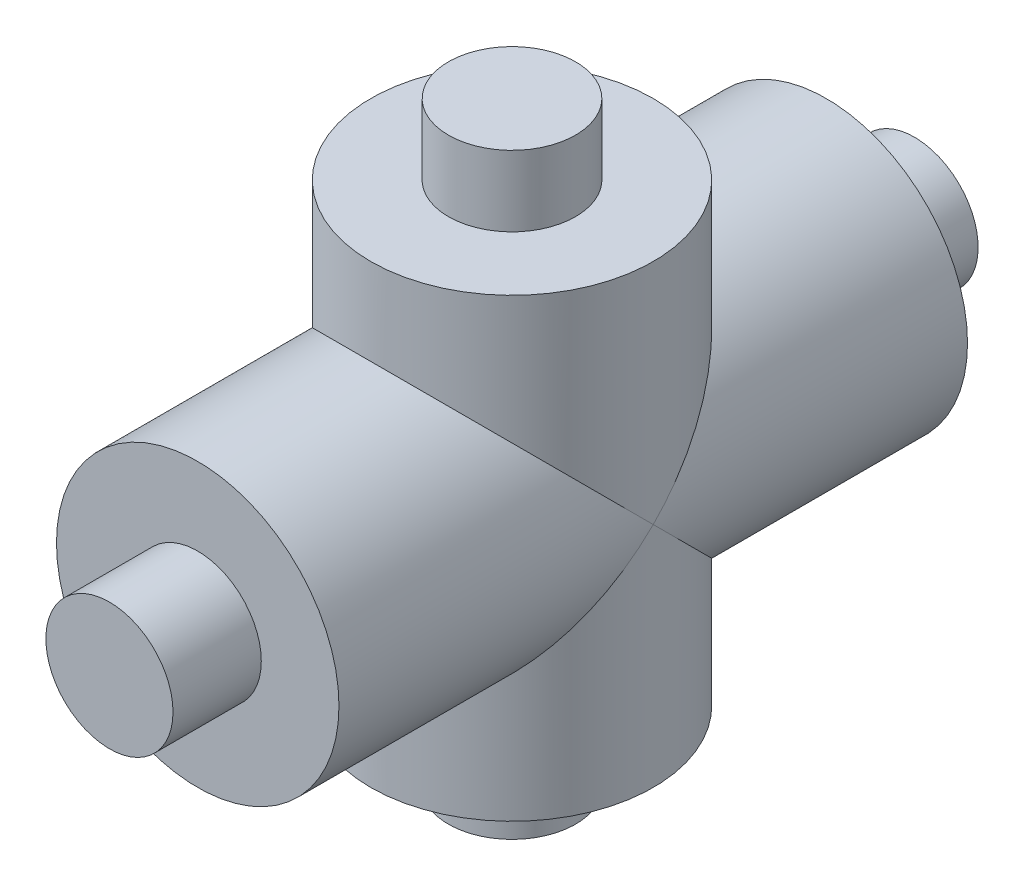
ISO-10303-21;
HEADER;
FILE_DESCRIPTION(('STEP AP214'),'2;1');
FILE_NAME('part.step','',(''),(''),'','','');
FILE_SCHEMA(('AUTOMOTIVE_DESIGN { 1 0 10303 214 1 1 1 1 }'));
ENDSEC;
DATA;
#1=APPLICATION_CONTEXT('core data for automotive mechanical design processes');
#2=APPLICATION_PROTOCOL_DEFINITION('international standard','automotive_design',2000,#1);
#3=PRODUCT_CONTEXT('',#1,'mechanical');
#4=PRODUCT('Part','Part','',(#3));
#5=PRODUCT_RELATED_PRODUCT_CATEGORY('part','',(#4));
#6=PRODUCT_DEFINITION_FORMATION('','',#4);
#7=PRODUCT_DEFINITION_CONTEXT('part definition',#1,'design');
#8=PRODUCT_DEFINITION('design','',#6,#7);
#9=PRODUCT_DEFINITION_SHAPE('','',#8);
#10=(LENGTH_UNIT() NAMED_UNIT(*) SI_UNIT(.MILLI.,.METRE.));
#11=(NAMED_UNIT(*) PLANE_ANGLE_UNIT() SI_UNIT($,.RADIAN.));
#12=(NAMED_UNIT(*) SI_UNIT($,.STERADIAN.) SOLID_ANGLE_UNIT());
#13=UNCERTAINTY_MEASURE_WITH_UNIT(LENGTH_MEASURE(1.E-05),#10,'distance_accuracy_value','');
#14=(GEOMETRIC_REPRESENTATION_CONTEXT(3) GLOBAL_UNCERTAINTY_ASSIGNED_CONTEXT((#13)) GLOBAL_UNIT_ASSIGNED_CONTEXT((#10,
#11,#12)) REPRESENTATION_CONTEXT('',''));
#15=CARTESIAN_POINT('',(0.,0.,0.));
#16=DIRECTION('',(0.,0.,1.));
#17=DIRECTION('',(1.,0.,0.));
#18=AXIS2_PLACEMENT_3D('',#15,#16,#17);
#19=CARTESIAN_POINT('',(0.,0.,17.8));
#20=DIRECTION('',(0.,0.,-1.));
#21=DIRECTION('',(-1.,0.,0.));
#22=AXIS2_PLACEMENT_3D('',#19,#20,#21);
#23=CYLINDRICAL_SURFACE('',#22,4.);
#24=CARTESIAN_POINT('',(0.,0.,8.9));
#25=DIRECTION('',(0.,-0.707106781186547,-0.707106781186548));
#26=DIRECTION('',(0.,0.707106781186547,-0.707106781186548));
#27=AXIS2_PLACEMENT_3D('',#24,#25,#26);
#28=ELLIPSE('',#27,5.65685424949238,4.);
#29=CARTESIAN_POINT('',(-4.,0.,8.9));
#30=VERTEX_POINT('',#29);
#31=CARTESIAN_POINT('',(4.,0.,8.9));
#32=VERTEX_POINT('',#31);
#33=EDGE_CURVE('E61',#30,#32,#28,.T.);
#34=ORIENTED_EDGE('',*,*,#33,.T.);
#35=CARTESIAN_POINT('',(0.,0.,8.9));
#36=DIRECTION('',(0.,0.707106781186547,-0.707106781186548));
#37=DIRECTION('',(0.,-0.707106781186547,-0.707106781186548));
#38=AXIS2_PLACEMENT_3D('',#35,#36,#37);
#39=ELLIPSE('',#38,5.65685424949238,4.);
#40=EDGE_CURVE('E66',#32,#30,#39,.T.);
#41=ORIENTED_EDGE('',*,*,#40,.T.);
#42=EDGE_LOOP('',(#34,#41));
#43=FACE_BOUND('',#42,.T.);
#44=CARTESIAN_POINT('',(0.,0.,0.));
#45=DIRECTION('',(0.,0.,1.));
#46=DIRECTION('',(1.,0.,0.));
#47=AXIS2_PLACEMENT_3D('',#44,#45,#46);
#48=CIRCLE('',#47,4.);
#49=CARTESIAN_POINT('',(4.,0.,0.));
#50=VERTEX_POINT('',#49);
#51=EDGE_CURVE('E78',#50,#50,#48,.T.);
#52=ORIENTED_EDGE('',*,*,#51,.T.);
#53=EDGE_LOOP('',(#52));
#54=FACE_BOUND('',#53,.T.);
#55=ADVANCED_FACE('F39',(#43,#54),#23,.T.);
#56=CARTESIAN_POINT('',(0.,0.,0.));
#57=DIRECTION('',(0.,0.,1.));
#58=DIRECTION('',(1.,0.,0.));
#59=AXIS2_PLACEMENT_3D('',#56,#57,#58);
#60=PLANE('',#59);
#61=CARTESIAN_POINT('',(0.,0.,0.));
#62=DIRECTION('',(0.,0.,-1.));
#63=DIRECTION('',(-1.,0.,0.));
#64=AXIS2_PLACEMENT_3D('',#61,#62,#63);
#65=CIRCLE('',#64,1.8);
#66=CARTESIAN_POINT('',(-1.8,0.,0.));
#67=VERTEX_POINT('',#66);
#68=EDGE_CURVE('E71',#67,#67,#65,.T.);
#69=ORIENTED_EDGE('',*,*,#68,.F.);
#70=EDGE_LOOP('',(#69));
#71=FACE_BOUND('',#70,.T.);
#72=ORIENTED_EDGE('',*,*,#51,.F.);
#73=EDGE_LOOP('',(#72));
#74=FACE_BOUND('',#73,.T.);
#75=ADVANCED_FACE('F147',(#71,#74),#60,.F.);
#76=CARTESIAN_POINT('',(0.,0.,-2.5));
#77=DIRECTION('',(0.,0.,1.));
#78=DIRECTION('',(1.,0.,0.));
#79=AXIS2_PLACEMENT_3D('',#76,#77,#78);
#80=CYLINDRICAL_SURFACE('',#79,1.8);
#81=CARTESIAN_POINT('',(0.,0.,-2.5));
#82=DIRECTION('',(0.,0.,-1.));
#83=DIRECTION('',(-1.,0.,0.));
#84=AXIS2_PLACEMENT_3D('',#81,#82,#83);
#85=CIRCLE('',#84,1.8);
#86=CARTESIAN_POINT('',(-1.8,0.,-2.5));
#87=VERTEX_POINT('',#86);
#88=EDGE_CURVE('E94',#87,#87,#85,.T.);
#89=ORIENTED_EDGE('',*,*,#88,.F.);
#90=EDGE_LOOP('',(#89));
#91=FACE_BOUND('',#90,.T.);
#92=ORIENTED_EDGE('',*,*,#68,.T.);
#93=EDGE_LOOP('',(#92));
#94=FACE_BOUND('',#93,.T.);
#95=ADVANCED_FACE('F151',(#91,#94),#80,.T.);
#96=CARTESIAN_POINT('',(0.,0.,-2.5));
#97=DIRECTION('',(0.,0.,-1.));
#98=DIRECTION('',(-1.,0.,0.));
#99=AXIS2_PLACEMENT_3D('',#96,#97,#98);
#100=PLANE('',#99);
#101=ORIENTED_EDGE('',*,*,#88,.T.);
#102=EDGE_LOOP('',(#101));
#103=FACE_BOUND('',#102,.T.);
#104=ADVANCED_FACE('F179',(#103),#100,.T.);
#105=CARTESIAN_POINT('',(0.,-6.45,8.9));
#106=DIRECTION('',(0.,1.,0.));
#107=DIRECTION('',(0.,0.,1.));
#108=AXIS2_PLACEMENT_3D('',#105,#106,#107);
#109=PLANE('',#108);
#110=CARTESIAN_POINT('',(0.,-6.45,8.9));
#111=DIRECTION('',(0.,-1.,0.));
#112=DIRECTION('',(0.,0.,-1.));
#113=AXIS2_PLACEMENT_3D('',#110,#111,#112);
#114=CIRCLE('',#113,1.8);
#115=CARTESIAN_POINT('',(0.,-6.45,7.1));
#116=VERTEX_POINT('',#115);
#117=EDGE_CURVE('E48',#116,#116,#114,.T.);
#118=ORIENTED_EDGE('',*,*,#117,.F.);
#119=EDGE_LOOP('',(#118));
#120=FACE_BOUND('',#119,.T.);
#121=CARTESIAN_POINT('',(0.,-6.45,8.9));
#122=DIRECTION('',(0.,1.,0.));
#123=DIRECTION('',(0.,0.,1.));
#124=AXIS2_PLACEMENT_3D('',#121,#122,#123);
#125=CIRCLE('',#124,4.);
#126=CARTESIAN_POINT('',(0.,-6.45,12.9));
#127=VERTEX_POINT('',#126);
#128=EDGE_CURVE('E101',#127,#127,#125,.T.);
#129=ORIENTED_EDGE('',*,*,#128,.F.);
#130=EDGE_LOOP('',(#129));
#131=FACE_BOUND('',#130,.T.);
#132=ADVANCED_FACE('F142',(#120,#131),#109,.F.);
#133=CARTESIAN_POINT('',(0.,-6.45,8.9));
#134=DIRECTION('',(0.,1.,0.));
#135=DIRECTION('',(0.,0.,1.));
#136=AXIS2_PLACEMENT_3D('',#133,#134,#135);
#137=CYLINDRICAL_SURFACE('',#136,4.);
#138=ORIENTED_EDGE('',*,*,#128,.T.);
#139=EDGE_LOOP('',(#138));
#140=FACE_BOUND('',#139,.T.);
#141=ORIENTED_EDGE('',*,*,#40,.F.);
#142=CARTESIAN_POINT('',(0.,0.,8.9));
#143=DIRECTION('',(0.,-0.707106781186547,-0.707106781186548));
#144=DIRECTION('',(0.,0.707106781186547,-0.707106781186548));
#145=AXIS2_PLACEMENT_3D('',#142,#143,#144);
#146=ELLIPSE('',#145,5.65685424949238,4.);
#147=EDGE_CURVE('E55',#30,#32,#146,.F.);
#148=ORIENTED_EDGE('',*,*,#147,.F.);
#149=EDGE_LOOP('',(#141,#148));
#150=FACE_BOUND('',#149,.T.);
#151=ADVANCED_FACE('F69',(#140,#150),#137,.T.);
#152=CARTESIAN_POINT('',(0.,6.45,8.9));
#153=DIRECTION('',(0.,1.,0.));
#154=DIRECTION('',(0.,0.,1.));
#155=AXIS2_PLACEMENT_3D('',#152,#153,#154);
#156=CIRCLE('',#155,4.);
#157=CARTESIAN_POINT('',(0.,6.45,12.9));
#158=VERTEX_POINT('',#157);
#159=EDGE_CURVE('E105',#158,#158,#156,.T.);
#160=ORIENTED_EDGE('',*,*,#159,.F.);
#161=EDGE_LOOP('',(#160));
#162=FACE_BOUND('',#161,.T.);
#163=CARTESIAN_POINT('',(0.,0.,8.9));
#164=DIRECTION('',(0.,0.707106781186547,-0.707106781186548));
#165=DIRECTION('',(0.,-0.707106781186547,-0.707106781186548));
#166=AXIS2_PLACEMENT_3D('',#163,#164,#165);
#167=ELLIPSE('',#166,5.65685424949238,4.);
#168=EDGE_CURVE('E42',#32,#30,#167,.F.);
#169=ORIENTED_EDGE('',*,*,#168,.F.);
#170=ORIENTED_EDGE('',*,*,#33,.F.);
#171=EDGE_LOOP('',(#169,#170));
#172=FACE_BOUND('',#171,.T.);
#173=ADVANCED_FACE('F62',(#162,#172),#137,.T.);
#174=CARTESIAN_POINT('',(0.,6.45,8.9));
#175=DIRECTION('',(0.,1.,0.));
#176=DIRECTION('',(0.,0.,1.));
#177=AXIS2_PLACEMENT_3D('',#174,#175,#176);
#178=PLANE('',#177);
#179=CARTESIAN_POINT('',(0.,6.45,8.9));
#180=DIRECTION('',(0.,1.,0.));
#181=DIRECTION('',(0.,0.,1.));
#182=AXIS2_PLACEMENT_3D('',#179,#180,#181);
#183=CIRCLE('',#182,1.8);
#184=CARTESIAN_POINT('',(0.,6.45,10.7));
#185=VERTEX_POINT('',#184);
#186=EDGE_CURVE('E11',#185,#185,#183,.T.);
#187=ORIENTED_EDGE('',*,*,#186,.F.);
#188=EDGE_LOOP('',(#187));
#189=FACE_BOUND('',#188,.T.);
#190=ORIENTED_EDGE('',*,*,#159,.T.);
#191=EDGE_LOOP('',(#190));
#192=FACE_BOUND('',#191,.T.);
#193=ADVANCED_FACE('F130',(#189,#192),#178,.T.);
#194=CARTESIAN_POINT('',(0.,0.,20.3));
#195=DIRECTION('',(0.,0.,1.));
#196=DIRECTION('',(1.,0.,0.));
#197=AXIS2_PLACEMENT_3D('',#194,#195,#196);
#198=PLANE('',#197);
#199=CARTESIAN_POINT('',(0.,0.,20.3));
#200=DIRECTION('',(0.,0.,1.));
#201=DIRECTION('',(1.,0.,0.));
#202=AXIS2_PLACEMENT_3D('',#199,#200,#201);
#203=CIRCLE('',#202,1.8);
#204=CARTESIAN_POINT('',(1.8,0.,20.3));
#205=VERTEX_POINT('',#204);
#206=EDGE_CURVE('E83',#205,#205,#203,.T.);
#207=ORIENTED_EDGE('',*,*,#206,.T.);
#208=EDGE_LOOP('',(#207));
#209=FACE_BOUND('',#208,.T.);
#210=ADVANCED_FACE('F133',(#209),#198,.T.);
#211=CARTESIAN_POINT('',(0.,0.,20.3));
#212=DIRECTION('',(0.,0.,-1.));
#213=DIRECTION('',(-1.,0.,0.));
#214=AXIS2_PLACEMENT_3D('',#211,#212,#213);
#215=CYLINDRICAL_SURFACE('',#214,1.8);
#216=ORIENTED_EDGE('',*,*,#206,.F.);
#217=EDGE_LOOP('',(#216));
#218=FACE_BOUND('',#217,.T.);
#219=CARTESIAN_POINT('',(0.,0.,17.8));
#220=DIRECTION('',(0.,0.,1.));
#221=DIRECTION('',(1.,0.,0.));
#222=AXIS2_PLACEMENT_3D('',#219,#220,#221);
#223=CIRCLE('',#222,1.8);
#224=CARTESIAN_POINT('',(1.8,0.,17.8));
#225=VERTEX_POINT('',#224);
#226=EDGE_CURVE('E87',#225,#225,#223,.T.);
#227=ORIENTED_EDGE('',*,*,#226,.T.);
#228=EDGE_LOOP('',(#227));
#229=FACE_BOUND('',#228,.T.);
#230=ADVANCED_FACE('F163',(#218,#229),#215,.T.);
#231=CARTESIAN_POINT('',(0.,0.,17.8));
#232=DIRECTION('',(0.,0.,1.));
#233=DIRECTION('',(1.,0.,0.));
#234=AXIS2_PLACEMENT_3D('',#231,#232,#233);
#235=PLANE('',#234);
#236=ORIENTED_EDGE('',*,*,#226,.F.);
#237=EDGE_LOOP('',(#236));
#238=FACE_BOUND('',#237,.T.);
#239=CARTESIAN_POINT('',(0.,0.,17.8));
#240=DIRECTION('',(0.,0.,1.));
#241=DIRECTION('',(1.,0.,0.));
#242=AXIS2_PLACEMENT_3D('',#239,#240,#241);
#243=CIRCLE('',#242,4.);
#244=CARTESIAN_POINT('',(4.,0.,17.8));
#245=VERTEX_POINT('',#244);
#246=EDGE_CURVE('E82',#245,#245,#243,.T.);
#247=ORIENTED_EDGE('',*,*,#246,.T.);
#248=EDGE_LOOP('',(#247));
#249=FACE_BOUND('',#248,.T.);
#250=ADVANCED_FACE('F155',(#238,#249),#235,.T.);
#251=ORIENTED_EDGE('',*,*,#246,.F.);
#252=EDGE_LOOP('',(#251));
#253=FACE_BOUND('',#252,.T.);
#254=ORIENTED_EDGE('',*,*,#147,.T.);
#255=ORIENTED_EDGE('',*,*,#168,.T.);
#256=EDGE_LOOP('',(#254,#255));
#257=FACE_BOUND('',#256,.T.);
#258=ADVANCED_FACE('F73',(#253,#257),#23,.T.);
#259=CARTESIAN_POINT('',(0.,-8.45,8.9));
#260=DIRECTION('',(0.,1.,0.));
#261=DIRECTION('',(0.,0.,1.));
#262=AXIS2_PLACEMENT_3D('',#259,#260,#261);
#263=CYLINDRICAL_SURFACE('',#262,1.8);
#264=CARTESIAN_POINT('',(0.,-8.45,8.9));
#265=DIRECTION('',(0.,-1.,0.));
#266=DIRECTION('',(0.,0.,-1.));
#267=AXIS2_PLACEMENT_3D('',#264,#265,#266);
#268=CIRCLE('',#267,1.8);
#269=CARTESIAN_POINT('',(0.,-8.45,7.1));
#270=VERTEX_POINT('',#269);
#271=EDGE_CURVE('E109',#270,#270,#268,.T.);
#272=ORIENTED_EDGE('',*,*,#271,.F.);
#273=EDGE_LOOP('',(#272));
#274=FACE_BOUND('',#273,.T.);
#275=ORIENTED_EDGE('',*,*,#117,.T.);
#276=EDGE_LOOP('',(#275));
#277=FACE_BOUND('',#276,.T.);
#278=ADVANCED_FACE('F154',(#274,#277),#263,.T.);
#279=CARTESIAN_POINT('',(0.,-8.45,8.9));
#280=DIRECTION('',(0.,-1.,0.));
#281=DIRECTION('',(0.,0.,-1.));
#282=AXIS2_PLACEMENT_3D('',#279,#280,#281);
#283=PLANE('',#282);
#284=ORIENTED_EDGE('',*,*,#271,.T.);
#285=EDGE_LOOP('',(#284));
#286=FACE_BOUND('',#285,.T.);
#287=ADVANCED_FACE('F126',(#286),#283,.T.);
#288=CARTESIAN_POINT('',(0.,8.45,8.9));
#289=DIRECTION('',(0.,-1.,0.));
#290=DIRECTION('',(0.,0.,-1.));
#291=AXIS2_PLACEMENT_3D('',#288,#289,#290);
#292=CYLINDRICAL_SURFACE('',#291,1.8);
#293=CARTESIAN_POINT('',(0.,8.45,8.9));
#294=DIRECTION('',(0.,1.,0.));
#295=DIRECTION('',(0.,0.,1.));
#296=AXIS2_PLACEMENT_3D('',#293,#294,#295);
#297=CIRCLE('',#296,1.8);
#298=CARTESIAN_POINT('',(0.,8.45,10.7));
#299=VERTEX_POINT('',#298);
#300=EDGE_CURVE('E115',#299,#299,#297,.T.);
#301=ORIENTED_EDGE('',*,*,#300,.F.);
#302=EDGE_LOOP('',(#301));
#303=FACE_BOUND('',#302,.T.);
#304=ORIENTED_EDGE('',*,*,#186,.T.);
#305=EDGE_LOOP('',(#304));
#306=FACE_BOUND('',#305,.T.);
#307=ADVANCED_FACE('F123',(#303,#306),#292,.T.);
#308=CARTESIAN_POINT('',(0.,8.45,8.9));
#309=DIRECTION('',(0.,1.,0.));
#310=DIRECTION('',(0.,0.,1.));
#311=AXIS2_PLACEMENT_3D('',#308,#309,#310);
#312=PLANE('',#311);
#313=ORIENTED_EDGE('',*,*,#300,.T.);
#314=EDGE_LOOP('',(#313));
#315=FACE_BOUND('',#314,.T.);
#316=ADVANCED_FACE('F121',(#315),#312,.T.);
#317=CLOSED_SHELL('',(#55,#75,#95,#104,#132,#151,#173,#193,#210,#230,#250,#258,#278,#287,#307,#316));
#318=MANIFOLD_SOLID_BREP('B2',#317);
#319=ADVANCED_BREP_SHAPE_REPRESENTATION('',(#18,#318),#14);
#320=SHAPE_DEFINITION_REPRESENTATION(#9,#319);
ENDSEC;
END-ISO-10303-21;
